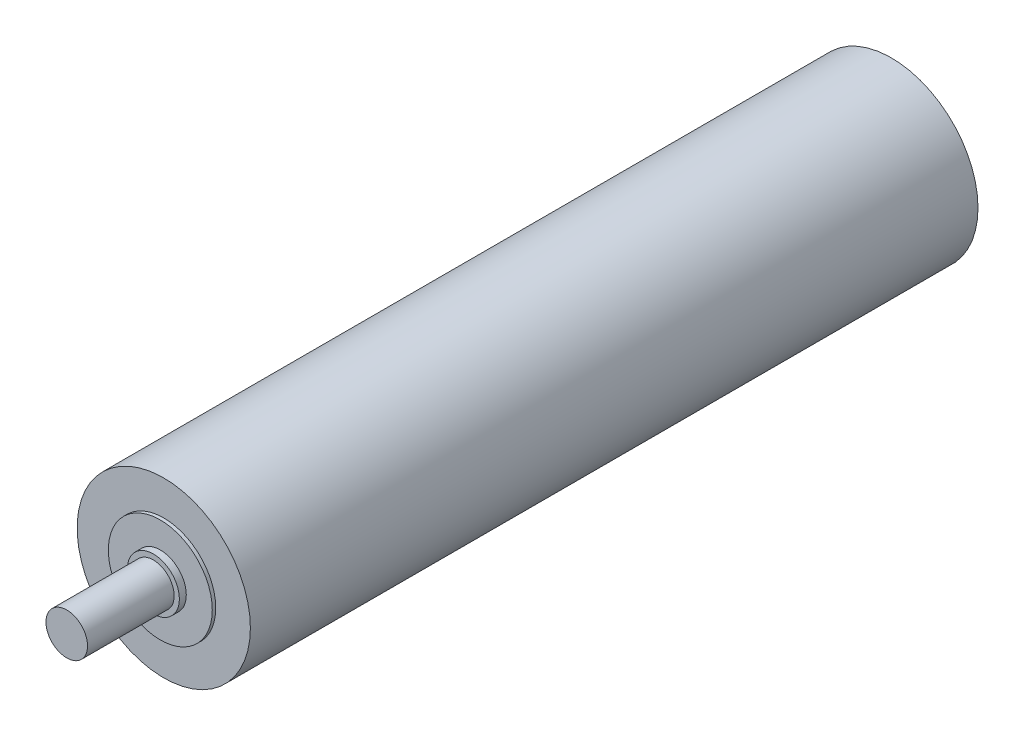
ISO-10303-21;
HEADER;
FILE_DESCRIPTION(('STEP AP214'),'2;1');
FILE_NAME('part.step','',(''),(''),'','','');
FILE_SCHEMA(('AUTOMOTIVE_DESIGN { 1 0 10303 214 1 1 1 1 }'));
ENDSEC;
DATA;
#1=APPLICATION_CONTEXT('core data for automotive mechanical design processes');
#2=APPLICATION_PROTOCOL_DEFINITION('international standard','automotive_design',2000,#1);
#3=PRODUCT_CONTEXT('',#1,'mechanical');
#4=PRODUCT('Part','Part','',(#3));
#5=PRODUCT_RELATED_PRODUCT_CATEGORY('part','',(#4));
#6=PRODUCT_DEFINITION_FORMATION('','',#4);
#7=PRODUCT_DEFINITION_CONTEXT('part definition',#1,'design');
#8=PRODUCT_DEFINITION('design','',#6,#7);
#9=PRODUCT_DEFINITION_SHAPE('','',#8);
#10=(LENGTH_UNIT() NAMED_UNIT(*) SI_UNIT(.MILLI.,.METRE.));
#11=(NAMED_UNIT(*) PLANE_ANGLE_UNIT() SI_UNIT($,.RADIAN.));
#12=(NAMED_UNIT(*) SI_UNIT($,.STERADIAN.) SOLID_ANGLE_UNIT());
#13=UNCERTAINTY_MEASURE_WITH_UNIT(LENGTH_MEASURE(1.E-05),#10,'distance_accuracy_value','');
#14=(GEOMETRIC_REPRESENTATION_CONTEXT(3) GLOBAL_UNCERTAINTY_ASSIGNED_CONTEXT((#13)) GLOBAL_UNIT_ASSIGNED_CONTEXT((#10,
#11,#12)) REPRESENTATION_CONTEXT('',''));
#15=CARTESIAN_POINT('',(0.,0.,0.));
#16=DIRECTION('',(0.,0.,1.));
#17=DIRECTION('',(1.,0.,0.));
#18=AXIS2_PLACEMENT_3D('',#15,#16,#17);
#19=CARTESIAN_POINT('',(0.,0.,-210.));
#20=DIRECTION('',(0.,0.,1.));
#21=DIRECTION('',(1.,0.,0.));
#22=AXIS2_PLACEMENT_3D('',#19,#20,#21);
#23=CYLINDRICAL_SURFACE('',#22,25.);
#24=CARTESIAN_POINT('',(0.,0.,-210.));
#25=DIRECTION('',(0.,0.,1.));
#26=DIRECTION('',(1.,0.,0.));
#27=AXIS2_PLACEMENT_3D('',#24,#25,#26);
#28=CIRCLE('',#27,25.);
#29=CARTESIAN_POINT('',(25.,0.,-210.));
#30=VERTEX_POINT('',#29);
#31=EDGE_CURVE('E55',#30,#30,#28,.T.);
#32=ORIENTED_EDGE('',*,*,#31,.T.);
#33=EDGE_LOOP('',(#32));
#34=FACE_BOUND('',#33,.T.);
#35=CARTESIAN_POINT('',(0.,0.,0.));
#36=DIRECTION('',(0.,0.,1.));
#37=DIRECTION('',(1.,0.,0.));
#38=AXIS2_PLACEMENT_3D('',#35,#36,#37);
#39=CIRCLE('',#38,25.);
#40=CARTESIAN_POINT('',(25.,0.,0.));
#41=VERTEX_POINT('',#40);
#42=EDGE_CURVE('E34',#41,#41,#39,.T.);
#43=ORIENTED_EDGE('',*,*,#42,.F.);
#44=EDGE_LOOP('',(#43));
#45=FACE_BOUND('',#44,.T.);
#46=ADVANCED_FACE('F31',(#34,#45),#23,.T.);
#47=CARTESIAN_POINT('',(0.,0.,-210.));
#48=DIRECTION('',(0.,0.,1.));
#49=DIRECTION('',(1.,0.,0.));
#50=AXIS2_PLACEMENT_3D('',#47,#48,#49);
#51=PLANE('',#50);
#52=ORIENTED_EDGE('',*,*,#31,.F.);
#53=EDGE_LOOP('',(#52));
#54=FACE_BOUND('',#53,.T.);
#55=ADVANCED_FACE('F65',(#54),#51,.F.);
#56=CARTESIAN_POINT('',(0.,0.,0.));
#57=DIRECTION('',(0.,0.,1.));
#58=DIRECTION('',(1.,0.,0.));
#59=AXIS2_PLACEMENT_3D('',#56,#57,#58);
#60=PLANE('',#59);
#61=CARTESIAN_POINT('',(0.,0.,0.));
#62=DIRECTION('',(0.,0.,1.));
#63=DIRECTION('',(1.,0.,0.));
#64=AXIS2_PLACEMENT_3D('',#61,#62,#63);
#65=CIRCLE('',#64,15.);
#66=CARTESIAN_POINT('',(15.,0.,0.));
#67=VERTEX_POINT('',#66);
#68=EDGE_CURVE('E43',#67,#67,#65,.T.);
#69=ORIENTED_EDGE('',*,*,#68,.F.);
#70=EDGE_LOOP('',(#69));
#71=FACE_BOUND('',#70,.T.);
#72=ORIENTED_EDGE('',*,*,#42,.T.);
#73=EDGE_LOOP('',(#72));
#74=FACE_BOUND('',#73,.T.);
#75=ADVANCED_FACE('F62',(#71,#74),#60,.T.);
#76=CARTESIAN_POINT('',(0.,0.,1.));
#77=DIRECTION('',(0.,0.,-1.));
#78=DIRECTION('',(-1.,0.,0.));
#79=AXIS2_PLACEMENT_3D('',#76,#77,#78);
#80=CYLINDRICAL_SURFACE('',#79,15.);
#81=CARTESIAN_POINT('',(0.,0.,1.));
#82=DIRECTION('',(0.,0.,1.));
#83=DIRECTION('',(1.,0.,0.));
#84=AXIS2_PLACEMENT_3D('',#81,#82,#83);
#85=CIRCLE('',#84,15.);
#86=CARTESIAN_POINT('',(15.,0.,1.));
#87=VERTEX_POINT('',#86);
#88=EDGE_CURVE('E50',#87,#87,#85,.T.);
#89=ORIENTED_EDGE('',*,*,#88,.F.);
#90=EDGE_LOOP('',(#89));
#91=FACE_BOUND('',#90,.T.);
#92=ORIENTED_EDGE('',*,*,#68,.T.);
#93=EDGE_LOOP('',(#92));
#94=FACE_BOUND('',#93,.T.);
#95=ADVANCED_FACE('F74',(#91,#94),#80,.T.);
#96=CARTESIAN_POINT('',(0.,0.,1.));
#97=DIRECTION('',(0.,0.,1.));
#98=DIRECTION('',(1.,0.,0.));
#99=AXIS2_PLACEMENT_3D('',#96,#97,#98);
#100=PLANE('',#99);
#101=CARTESIAN_POINT('',(0.,0.,1.));
#102=DIRECTION('',(0.,0.,1.));
#103=DIRECTION('',(1.,0.,0.));
#104=AXIS2_PLACEMENT_3D('',#101,#102,#103);
#105=CIRCLE('',#104,7.5);
#106=CARTESIAN_POINT('',(7.5,0.,1.));
#107=VERTEX_POINT('',#106);
#108=EDGE_CURVE('E38',#107,#107,#105,.T.);
#109=ORIENTED_EDGE('',*,*,#108,.F.);
#110=EDGE_LOOP('',(#109));
#111=FACE_BOUND('',#110,.T.);
#112=ORIENTED_EDGE('',*,*,#88,.T.);
#113=EDGE_LOOP('',(#112));
#114=FACE_BOUND('',#113,.T.);
#115=ADVANCED_FACE('F79',(#111,#114),#100,.T.);
#116=CARTESIAN_POINT('',(0.,0.,3.));
#117=DIRECTION('',(0.,0.,-1.));
#118=DIRECTION('',(-1.,0.,0.));
#119=AXIS2_PLACEMENT_3D('',#116,#117,#118);
#120=CYLINDRICAL_SURFACE('',#119,7.5);
#121=CARTESIAN_POINT('',(0.,0.,3.));
#122=DIRECTION('',(0.,0.,1.));
#123=DIRECTION('',(1.,0.,0.));
#124=AXIS2_PLACEMENT_3D('',#121,#122,#123);
#125=CIRCLE('',#124,7.5);
#126=CARTESIAN_POINT('',(7.5,0.,3.));
#127=VERTEX_POINT('',#126);
#128=EDGE_CURVE('E48',#127,#127,#125,.T.);
#129=ORIENTED_EDGE('',*,*,#128,.F.);
#130=EDGE_LOOP('',(#129));
#131=FACE_BOUND('',#130,.T.);
#132=ORIENTED_EDGE('',*,*,#108,.T.);
#133=EDGE_LOOP('',(#132));
#134=FACE_BOUND('',#133,.T.);
#135=ADVANCED_FACE('F83',(#131,#134),#120,.T.);
#136=CARTESIAN_POINT('',(0.,0.,3.));
#137=DIRECTION('',(0.,0.,1.));
#138=DIRECTION('',(1.,0.,0.));
#139=AXIS2_PLACEMENT_3D('',#136,#137,#138);
#140=PLANE('',#139);
#141=CARTESIAN_POINT('',(0.,0.,3.));
#142=DIRECTION('',(0.,0.,1.));
#143=DIRECTION('',(1.,0.,0.));
#144=AXIS2_PLACEMENT_3D('',#141,#142,#143);
#145=CIRCLE('',#144,6.);
#146=CARTESIAN_POINT('',(6.,0.,3.));
#147=VERTEX_POINT('',#146);
#148=EDGE_CURVE('E10',#147,#147,#145,.T.);
#149=ORIENTED_EDGE('',*,*,#148,.F.);
#150=EDGE_LOOP('',(#149));
#151=FACE_BOUND('',#150,.T.);
#152=ORIENTED_EDGE('',*,*,#128,.T.);
#153=EDGE_LOOP('',(#152));
#154=FACE_BOUND('',#153,.T.);
#155=ADVANCED_FACE('F87',(#151,#154),#140,.T.);
#156=CARTESIAN_POINT('',(0.,0.,28.));
#157=DIRECTION('',(0.,0.,-1.));
#158=DIRECTION('',(-1.,0.,0.));
#159=AXIS2_PLACEMENT_3D('',#156,#157,#158);
#160=CYLINDRICAL_SURFACE('',#159,6.);
#161=CARTESIAN_POINT('',(0.,0.,28.));
#162=DIRECTION('',(0.,0.,1.));
#163=DIRECTION('',(1.,0.,0.));
#164=AXIS2_PLACEMENT_3D('',#161,#162,#163);
#165=CIRCLE('',#164,6.);
#166=CARTESIAN_POINT('',(6.,0.,28.));
#167=VERTEX_POINT('',#166);
#168=EDGE_CURVE('E47',#167,#167,#165,.T.);
#169=ORIENTED_EDGE('',*,*,#168,.F.);
#170=EDGE_LOOP('',(#169));
#171=FACE_BOUND('',#170,.T.);
#172=ORIENTED_EDGE('',*,*,#148,.T.);
#173=EDGE_LOOP('',(#172));
#174=FACE_BOUND('',#173,.T.);
#175=ADVANCED_FACE('F91',(#171,#174),#160,.T.);
#176=CARTESIAN_POINT('',(0.,0.,28.));
#177=DIRECTION('',(0.,0.,1.));
#178=DIRECTION('',(1.,0.,0.));
#179=AXIS2_PLACEMENT_3D('',#176,#177,#178);
#180=PLANE('',#179);
#181=ORIENTED_EDGE('',*,*,#168,.T.);
#182=EDGE_LOOP('',(#181));
#183=FACE_BOUND('',#182,.T.);
#184=ADVANCED_FACE('F95',(#183),#180,.T.);
#185=CLOSED_SHELL('',(#46,#55,#75,#95,#115,#135,#155,#175,#184));
#186=MANIFOLD_SOLID_BREP('B2',#185);
#187=ADVANCED_BREP_SHAPE_REPRESENTATION('',(#18,#186),#14);
#188=SHAPE_DEFINITION_REPRESENTATION(#9,#187);
ENDSEC;
END-ISO-10303-21;
